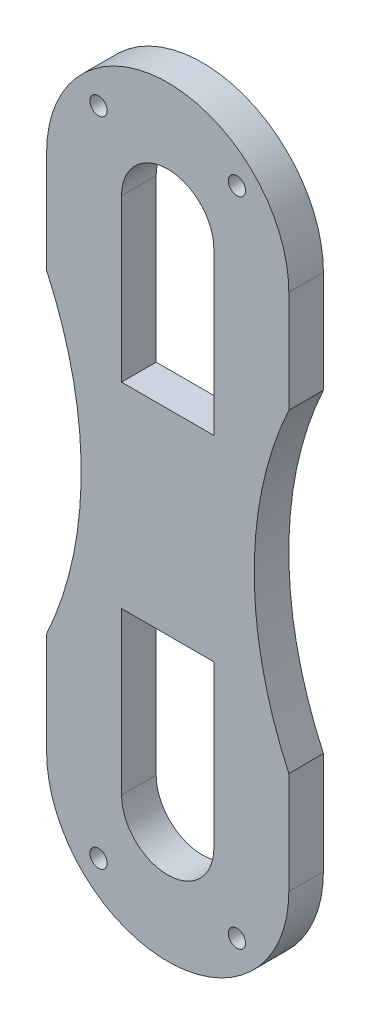
ISO-10303-21;
HEADER;
FILE_DESCRIPTION(('STEP AP214'),'2;1');
FILE_NAME('part.step','',(''),(''),'','','');
FILE_SCHEMA(('AUTOMOTIVE_DESIGN { 1 0 10303 214 1 1 1 1 }'));
ENDSEC;
DATA;
#1=APPLICATION_CONTEXT('core data for automotive mechanical design processes');
#2=APPLICATION_PROTOCOL_DEFINITION('international standard','automotive_design',2000,#1);
#3=PRODUCT_CONTEXT('',#1,'mechanical');
#4=PRODUCT('Part','Part','',(#3));
#5=PRODUCT_RELATED_PRODUCT_CATEGORY('part','',(#4));
#6=PRODUCT_DEFINITION_FORMATION('','',#4);
#7=PRODUCT_DEFINITION_CONTEXT('part definition',#1,'design');
#8=PRODUCT_DEFINITION('design','',#6,#7);
#9=PRODUCT_DEFINITION_SHAPE('','',#8);
#10=(LENGTH_UNIT() NAMED_UNIT(*) SI_UNIT(.MILLI.,.METRE.));
#11=(NAMED_UNIT(*) PLANE_ANGLE_UNIT() SI_UNIT($,.RADIAN.));
#12=(NAMED_UNIT(*) SI_UNIT($,.STERADIAN.) SOLID_ANGLE_UNIT());
#13=UNCERTAINTY_MEASURE_WITH_UNIT(LENGTH_MEASURE(1.E-05),#10,'distance_accuracy_value','');
#14=(GEOMETRIC_REPRESENTATION_CONTEXT(3) GLOBAL_UNCERTAINTY_ASSIGNED_CONTEXT((#13)) GLOBAL_UNIT_ASSIGNED_CONTEXT((#10,
#11,#12)) REPRESENTATION_CONTEXT('',''));
#15=CARTESIAN_POINT('',(0.,0.,0.));
#16=DIRECTION('',(0.,0.,1.));
#17=DIRECTION('',(1.,0.,0.));
#18=AXIS2_PLACEMENT_3D('',#15,#16,#17);
#19=CARTESIAN_POINT('',(4.,0.,3.));
#20=DIRECTION('',(-1.,0.,0.));
#21=DIRECTION('',(0.,-1.,0.));
#22=AXIS2_PLACEMENT_3D('',#19,#20,#21);
#23=PLANE('',#22);
#24=DIRECTION('',(0.,1.,0.));
#25=VECTOR('',#24,1.);
#26=CARTESIAN_POINT('',(4.,0.,0.));
#27=LINE('',#26,#25);
#28=CARTESIAN_POINT('',(3.99999999999999,-22.5000003712386,0.));
#29=VERTEX_POINT('',#28);
#30=CARTESIAN_POINT('',(4.,-8.50000000000002,0.));
#31=VERTEX_POINT('',#30);
#32=EDGE_CURVE('E258',#29,#31,#27,.T.);
#33=ORIENTED_EDGE('',*,*,#32,.F.);
#34=DIRECTION('',(0.,0.,-1.));
#35=VECTOR('',#34,1.);
#36=CARTESIAN_POINT('',(3.99999999999999,-22.5000003712386,3.));
#37=LINE('',#36,#35);
#38=CARTESIAN_POINT('',(3.99999999999999,-22.5000003712386,3.));
#39=VERTEX_POINT('',#38);
#40=EDGE_CURVE('E11',#39,#29,#37,.T.);
#41=ORIENTED_EDGE('',*,*,#40,.F.);
#42=DIRECTION('',(0.,1.,0.));
#43=VECTOR('',#42,1.);
#44=CARTESIAN_POINT('',(4.,0.,3.));
#45=LINE('',#44,#43);
#46=CARTESIAN_POINT('',(4.,-8.50000000000002,3.));
#47=VERTEX_POINT('',#46);
#48=EDGE_CURVE('E170',#39,#47,#45,.T.);
#49=ORIENTED_EDGE('',*,*,#48,.T.);
#50=DIRECTION('',(0.,0.,-1.));
#51=VECTOR('',#50,1.);
#52=CARTESIAN_POINT('',(4.,-8.50000000000002,3.));
#53=LINE('',#52,#51);
#54=EDGE_CURVE('E111',#47,#31,#53,.T.);
#55=ORIENTED_EDGE('',*,*,#54,.T.);
#56=EDGE_LOOP('',(#33,#41,#49,#55));
#57=FACE_BOUND('',#56,.T.);
#58=ADVANCED_FACE('F34',(#57),#23,.T.);
#59=CARTESIAN_POINT('',(0.,-22.5,3.));
#60=DIRECTION('',(0.,0.,-1.));
#61=DIRECTION('',(-1.,0.,0.));
#62=AXIS2_PLACEMENT_3D('',#59,#60,#61);
#63=CYLINDRICAL_SURFACE('',#62,4.00000000000002);
#64=CARTESIAN_POINT('',(0.,-22.5,0.));
#65=DIRECTION('',(0.,0.,1.));
#66=DIRECTION('',(1.,0.,0.));
#67=AXIS2_PLACEMENT_3D('',#64,#65,#66);
#68=CIRCLE('',#67,4.00000000000002);
#69=CARTESIAN_POINT('',(-4.00000000000001,-22.4999996286907,0.));
#70=VERTEX_POINT('',#69);
#71=EDGE_CURVE('E175',#29,#70,#68,.F.);
#72=ORIENTED_EDGE('',*,*,#71,.T.);
#73=DIRECTION('',(0.,0.,-1.));
#74=VECTOR('',#73,1.);
#75=CARTESIAN_POINT('',(-4.00000000000001,-22.4999996286907,3.));
#76=LINE('',#75,#74);
#77=CARTESIAN_POINT('',(-4.00000000000001,-22.4999996286907,3.));
#78=VERTEX_POINT('',#77);
#79=EDGE_CURVE('E44',#78,#70,#76,.T.);
#80=ORIENTED_EDGE('',*,*,#79,.F.);
#81=CARTESIAN_POINT('',(0.,-22.5,3.));
#82=DIRECTION('',(0.,0.,1.));
#83=DIRECTION('',(1.,0.,0.));
#84=AXIS2_PLACEMENT_3D('',#81,#82,#83);
#85=CIRCLE('',#84,4.00000000000002);
#86=EDGE_CURVE('E165',#39,#78,#85,.F.);
#87=ORIENTED_EDGE('',*,*,#86,.F.);
#88=ORIENTED_EDGE('',*,*,#40,.T.);
#89=EDGE_LOOP('',(#72,#80,#87,#88));
#90=FACE_BOUND('',#89,.T.);
#91=ADVANCED_FACE('F173',(#90),#63,.F.);
#92=CARTESIAN_POINT('',(-4.00000000000001,0.,3.));
#93=DIRECTION('',(-1.,0.,0.));
#94=DIRECTION('',(0.,-1.,0.));
#95=AXIS2_PLACEMENT_3D('',#92,#93,#94);
#96=PLANE('',#95);
#97=DIRECTION('',(0.,1.,0.));
#98=VECTOR('',#97,1.);
#99=CARTESIAN_POINT('',(-4.00000000000001,0.,0.));
#100=LINE('',#99,#98);
#101=CARTESIAN_POINT('',(-4.00000000000001,-8.50000000000002,0.));
#102=VERTEX_POINT('',#101);
#103=EDGE_CURVE('E261',#70,#102,#100,.T.);
#104=ORIENTED_EDGE('',*,*,#103,.T.);
#105=DIRECTION('',(0.,0.,-1.));
#106=VECTOR('',#105,1.);
#107=CARTESIAN_POINT('',(-4.00000000000001,-8.50000000000002,3.));
#108=LINE('',#107,#106);
#109=CARTESIAN_POINT('',(-4.00000000000001,-8.50000000000002,3.));
#110=VERTEX_POINT('',#109);
#111=EDGE_CURVE('E164',#110,#102,#108,.T.);
#112=ORIENTED_EDGE('',*,*,#111,.F.);
#113=DIRECTION('',(0.,1.,0.));
#114=VECTOR('',#113,1.);
#115=CARTESIAN_POINT('',(-4.00000000000001,0.,3.));
#116=LINE('',#115,#114);
#117=EDGE_CURVE('E158',#78,#110,#116,.T.);
#118=ORIENTED_EDGE('',*,*,#117,.F.);
#119=ORIENTED_EDGE('',*,*,#79,.T.);
#120=EDGE_LOOP('',(#104,#112,#118,#119));
#121=FACE_BOUND('',#120,.T.);
#122=ADVANCED_FACE('F161',(#121),#96,.F.);
#123=CARTESIAN_POINT('',(-10.5,0.,3.));
#124=DIRECTION('',(1.,0.,0.));
#125=DIRECTION('',(0.,1.,0.));
#126=AXIS2_PLACEMENT_3D('',#123,#124,#125);
#127=PLANE('',#126);
#128=DIRECTION('',(0.,-1.,0.));
#129=VECTOR('',#128,1.);
#130=CARTESIAN_POINT('',(-10.5,0.,0.));
#131=LINE('',#130,#129);
#132=CARTESIAN_POINT('',(-10.5,22.5,0.));
#133=VERTEX_POINT('',#132);
#134=CARTESIAN_POINT('',(-10.5,13.6381816969859,0.));
#135=VERTEX_POINT('',#134);
#136=EDGE_CURVE('E236',#133,#135,#131,.T.);
#137=ORIENTED_EDGE('',*,*,#136,.T.);
#138=DIRECTION('',(0.,0.,-1.));
#139=VECTOR('',#138,1.);
#140=CARTESIAN_POINT('',(-10.5,13.6381816969859,3.));
#141=LINE('',#140,#139);
#142=CARTESIAN_POINT('',(-10.5,13.6381816969859,3.));
#143=VERTEX_POINT('',#142);
#144=EDGE_CURVE('E196',#143,#135,#141,.T.);
#145=ORIENTED_EDGE('',*,*,#144,.F.);
#146=DIRECTION('',(0.,-1.,0.));
#147=VECTOR('',#146,1.);
#148=CARTESIAN_POINT('',(-10.5,0.,3.));
#149=LINE('',#148,#147);
#150=CARTESIAN_POINT('',(-10.5,22.5,3.));
#151=VERTEX_POINT('',#150);
#152=EDGE_CURVE('E288',#151,#143,#149,.T.);
#153=ORIENTED_EDGE('',*,*,#152,.F.);
#154=DIRECTION('',(0.,0.,-1.));
#155=VECTOR('',#154,1.);
#156=CARTESIAN_POINT('',(-10.5,22.5,3.));
#157=LINE('',#156,#155);
#158=EDGE_CURVE('E180',#151,#133,#157,.T.);
#159=ORIENTED_EDGE('',*,*,#158,.T.);
#160=EDGE_LOOP('',(#137,#145,#153,#159));
#161=FACE_BOUND('',#160,.T.);
#162=ADVANCED_FACE('F373',(#161),#127,.F.);
#163=CARTESIAN_POINT('',(-40.,0.,3.));
#164=DIRECTION('',(0.,0.,-1.));
#165=DIRECTION('',(-1.,0.,0.));
#166=AXIS2_PLACEMENT_3D('',#163,#164,#165);
#167=CYLINDRICAL_SURFACE('',#166,32.5);
#168=CARTESIAN_POINT('',(-40.,0.,0.));
#169=DIRECTION('',(0.,0.,1.));
#170=DIRECTION('',(1.,0.,0.));
#171=AXIS2_PLACEMENT_3D('',#168,#169,#170);
#172=CIRCLE('',#171,32.5);
#173=CARTESIAN_POINT('',(-10.5,-13.6381816969859,0.));
#174=VERTEX_POINT('',#173);
#175=EDGE_CURVE('E239',#135,#174,#172,.F.);
#176=ORIENTED_EDGE('',*,*,#175,.T.);
#177=DIRECTION('',(0.,0.,-1.));
#178=VECTOR('',#177,1.);
#179=CARTESIAN_POINT('',(-10.5,-13.6381816969859,3.));
#180=LINE('',#179,#178);
#181=CARTESIAN_POINT('',(-10.5,-13.6381816969859,3.));
#182=VERTEX_POINT('',#181);
#183=EDGE_CURVE('E193',#182,#174,#180,.T.);
#184=ORIENTED_EDGE('',*,*,#183,.F.);
#185=CARTESIAN_POINT('',(-40.,0.,3.));
#186=DIRECTION('',(0.,0.,1.));
#187=DIRECTION('',(1.,0.,0.));
#188=AXIS2_PLACEMENT_3D('',#185,#186,#187);
#189=CIRCLE('',#188,32.5);
#190=EDGE_CURVE('E291',#143,#182,#189,.F.);
#191=ORIENTED_EDGE('',*,*,#190,.F.);
#192=ORIENTED_EDGE('',*,*,#144,.T.);
#193=EDGE_LOOP('',(#176,#184,#191,#192));
#194=FACE_BOUND('',#193,.T.);
#195=ADVANCED_FACE('F369',(#194),#167,.F.);
#196=CARTESIAN_POINT('',(-10.5,0.,3.));
#197=DIRECTION('',(1.,0.,0.));
#198=DIRECTION('',(0.,1.,0.));
#199=AXIS2_PLACEMENT_3D('',#196,#197,#198);
#200=PLANE('',#199);
#201=DIRECTION('',(0.,-1.,0.));
#202=VECTOR('',#201,1.);
#203=CARTESIAN_POINT('',(-10.5,0.,0.));
#204=LINE('',#203,#202);
#205=CARTESIAN_POINT('',(-10.5,-22.5,0.));
#206=VERTEX_POINT('',#205);
#207=EDGE_CURVE('E241',#174,#206,#204,.T.);
#208=ORIENTED_EDGE('',*,*,#207,.T.);
#209=DIRECTION('',(0.,0.,-1.));
#210=VECTOR('',#209,1.);
#211=CARTESIAN_POINT('',(-10.5,-22.5,3.));
#212=LINE('',#211,#210);
#213=CARTESIAN_POINT('',(-10.5,-22.5,3.));
#214=VERTEX_POINT('',#213);
#215=EDGE_CURVE('E191',#214,#206,#212,.T.);
#216=ORIENTED_EDGE('',*,*,#215,.F.);
#217=DIRECTION('',(0.,-1.,0.));
#218=VECTOR('',#217,1.);
#219=CARTESIAN_POINT('',(-10.5,0.,3.));
#220=LINE('',#219,#218);
#221=EDGE_CURVE('E293',#182,#214,#220,.T.);
#222=ORIENTED_EDGE('',*,*,#221,.F.);
#223=ORIENTED_EDGE('',*,*,#183,.T.);
#224=EDGE_LOOP('',(#208,#216,#222,#223));
#225=FACE_BOUND('',#224,.T.);
#226=ADVANCED_FACE('F365',(#225),#200,.F.);
#227=CARTESIAN_POINT('',(0.,-22.5,3.));
#228=DIRECTION('',(0.,0.,-1.));
#229=DIRECTION('',(-1.,0.,0.));
#230=AXIS2_PLACEMENT_3D('',#227,#228,#229);
#231=CYLINDRICAL_SURFACE('',#230,10.5);
#232=CARTESIAN_POINT('',(0.,-22.5,0.));
#233=DIRECTION('',(0.,0.,1.));
#234=DIRECTION('',(1.,0.,0.));
#235=AXIS2_PLACEMENT_3D('',#232,#233,#234);
#236=CIRCLE('',#235,10.5);
#237=CARTESIAN_POINT('',(10.5,-22.5,0.));
#238=VERTEX_POINT('',#237);
#239=EDGE_CURVE('E244',#238,#206,#236,.F.);
#240=ORIENTED_EDGE('',*,*,#239,.F.);
#241=DIRECTION('',(0.,0.,-1.));
#242=VECTOR('',#241,1.);
#243=CARTESIAN_POINT('',(10.5,-22.5,3.));
#244=LINE('',#243,#242);
#245=CARTESIAN_POINT('',(10.5,-22.5,3.));
#246=VERTEX_POINT('',#245);
#247=EDGE_CURVE('E189',#246,#238,#244,.T.);
#248=ORIENTED_EDGE('',*,*,#247,.F.);
#249=CARTESIAN_POINT('',(0.,-22.5,3.));
#250=DIRECTION('',(0.,0.,1.));
#251=DIRECTION('',(1.,0.,0.));
#252=AXIS2_PLACEMENT_3D('',#249,#250,#251);
#253=CIRCLE('',#252,10.5);
#254=EDGE_CURVE('E295',#246,#214,#253,.F.);
#255=ORIENTED_EDGE('',*,*,#254,.T.);
#256=ORIENTED_EDGE('',*,*,#215,.T.);
#257=EDGE_LOOP('',(#240,#248,#255,#256));
#258=FACE_BOUND('',#257,.T.);
#259=ADVANCED_FACE('F361',(#258),#231,.T.);
#260=CARTESIAN_POINT('',(10.5,0.,3.));
#261=DIRECTION('',(1.,0.,0.));
#262=DIRECTION('',(0.,1.,0.));
#263=AXIS2_PLACEMENT_3D('',#260,#261,#262);
#264=PLANE('',#263);
#265=DIRECTION('',(0.,-1.,0.));
#266=VECTOR('',#265,1.);
#267=CARTESIAN_POINT('',(10.5,0.,0.));
#268=LINE('',#267,#266);
#269=CARTESIAN_POINT('',(10.5,-13.6381816969859,0.));
#270=VERTEX_POINT('',#269);
#271=EDGE_CURVE('E247',#270,#238,#268,.T.);
#272=ORIENTED_EDGE('',*,*,#271,.F.);
#273=DIRECTION('',(0.,0.,-1.));
#274=VECTOR('',#273,1.);
#275=CARTESIAN_POINT('',(10.5,-13.6381816969859,3.));
#276=LINE('',#275,#274);
#277=CARTESIAN_POINT('',(10.5,-13.6381816969859,3.));
#278=VERTEX_POINT('',#277);
#279=EDGE_CURVE('E187',#278,#270,#276,.T.);
#280=ORIENTED_EDGE('',*,*,#279,.F.);
#281=DIRECTION('',(0.,-1.,0.));
#282=VECTOR('',#281,1.);
#283=CARTESIAN_POINT('',(10.5,0.,3.));
#284=LINE('',#283,#282);
#285=EDGE_CURVE('E298',#278,#246,#284,.T.);
#286=ORIENTED_EDGE('',*,*,#285,.T.);
#287=ORIENTED_EDGE('',*,*,#247,.T.);
#288=EDGE_LOOP('',(#272,#280,#286,#287));
#289=FACE_BOUND('',#288,.T.);
#290=ADVANCED_FACE('F357',(#289),#264,.T.);
#291=CARTESIAN_POINT('',(40.,0.,3.));
#292=DIRECTION('',(0.,0.,-1.));
#293=DIRECTION('',(-1.,0.,0.));
#294=AXIS2_PLACEMENT_3D('',#291,#292,#293);
#295=CYLINDRICAL_SURFACE('',#294,32.5);
#296=CARTESIAN_POINT('',(40.,0.,0.));
#297=DIRECTION('',(0.,0.,1.));
#298=DIRECTION('',(1.,0.,0.));
#299=AXIS2_PLACEMENT_3D('',#296,#297,#298);
#300=CIRCLE('',#299,32.5);
#301=CARTESIAN_POINT('',(10.5,13.6381816969859,0.));
#302=VERTEX_POINT('',#301);
#303=EDGE_CURVE('E250',#302,#270,#300,.T.);
#304=ORIENTED_EDGE('',*,*,#303,.F.);
#305=DIRECTION('',(0.,0.,-1.));
#306=VECTOR('',#305,1.);
#307=CARTESIAN_POINT('',(10.5,13.6381816969859,3.));
#308=LINE('',#307,#306);
#309=CARTESIAN_POINT('',(10.5,13.6381816969859,3.));
#310=VERTEX_POINT('',#309);
#311=EDGE_CURVE('E185',#310,#302,#308,.T.);
#312=ORIENTED_EDGE('',*,*,#311,.F.);
#313=CARTESIAN_POINT('',(40.,0.,3.));
#314=DIRECTION('',(0.,0.,1.));
#315=DIRECTION('',(1.,0.,0.));
#316=AXIS2_PLACEMENT_3D('',#313,#314,#315);
#317=CIRCLE('',#316,32.5);
#318=EDGE_CURVE('E301',#310,#278,#317,.T.);
#319=ORIENTED_EDGE('',*,*,#318,.T.);
#320=ORIENTED_EDGE('',*,*,#279,.T.);
#321=EDGE_LOOP('',(#304,#312,#319,#320));
#322=FACE_BOUND('',#321,.T.);
#323=ADVANCED_FACE('F353',(#322),#295,.F.);
#324=CARTESIAN_POINT('',(10.5,0.,3.));
#325=DIRECTION('',(1.,0.,0.));
#326=DIRECTION('',(0.,1.,0.));
#327=AXIS2_PLACEMENT_3D('',#324,#325,#326);
#328=PLANE('',#327);
#329=DIRECTION('',(0.,-1.,0.));
#330=VECTOR('',#329,1.);
#331=CARTESIAN_POINT('',(10.5,0.,0.));
#332=LINE('',#331,#330);
#333=CARTESIAN_POINT('',(10.5,22.5,0.));
#334=VERTEX_POINT('',#333);
#335=EDGE_CURVE('E253',#334,#302,#332,.T.);
#336=ORIENTED_EDGE('',*,*,#335,.F.);
#337=DIRECTION('',(0.,0.,-1.));
#338=VECTOR('',#337,1.);
#339=CARTESIAN_POINT('',(10.5,22.5,3.));
#340=LINE('',#339,#338);
#341=CARTESIAN_POINT('',(10.5,22.5,3.));
#342=VERTEX_POINT('',#341);
#343=EDGE_CURVE('E183',#342,#334,#340,.T.);
#344=ORIENTED_EDGE('',*,*,#343,.F.);
#345=DIRECTION('',(0.,-1.,0.));
#346=VECTOR('',#345,1.);
#347=CARTESIAN_POINT('',(10.5,0.,3.));
#348=LINE('',#347,#346);
#349=EDGE_CURVE('E304',#342,#310,#348,.T.);
#350=ORIENTED_EDGE('',*,*,#349,.T.);
#351=ORIENTED_EDGE('',*,*,#311,.T.);
#352=EDGE_LOOP('',(#336,#344,#350,#351));
#353=FACE_BOUND('',#352,.T.);
#354=ADVANCED_FACE('F350',(#353),#328,.T.);
#355=CARTESIAN_POINT('',(0.,22.5,3.));
#356=DIRECTION('',(0.,0.,-1.));
#357=DIRECTION('',(-1.,0.,0.));
#358=AXIS2_PLACEMENT_3D('',#355,#356,#357);
#359=CYLINDRICAL_SURFACE('',#358,4.00000000000002);
#360=CARTESIAN_POINT('',(0.,22.5,0.));
#361=DIRECTION('',(0.,0.,1.));
#362=DIRECTION('',(1.,0.,0.));
#363=AXIS2_PLACEMENT_3D('',#360,#361,#362);
#364=CIRCLE('',#363,4.00000000000002);
#365=CARTESIAN_POINT('',(3.99999999999999,22.5000003712386,0.));
#366=VERTEX_POINT('',#365);
#367=CARTESIAN_POINT('',(-4.00000000000001,22.4999996286907,0.));
#368=VERTEX_POINT('',#367);
#369=EDGE_CURVE('E221',#366,#368,#364,.T.);
#370=ORIENTED_EDGE('',*,*,#369,.F.);
#371=DIRECTION('',(0.,0.,-1.));
#372=VECTOR('',#371,1.);
#373=CARTESIAN_POINT('',(3.99999999999999,22.5000003712386,3.));
#374=LINE('',#373,#372);
#375=CARTESIAN_POINT('',(3.99999999999999,22.5000003712386,3.));
#376=VERTEX_POINT('',#375);
#377=EDGE_CURVE('E38',#376,#366,#374,.T.);
#378=ORIENTED_EDGE('',*,*,#377,.F.);
#379=CARTESIAN_POINT('',(0.,22.5,3.));
#380=DIRECTION('',(0.,0.,1.));
#381=DIRECTION('',(1.,0.,0.));
#382=AXIS2_PLACEMENT_3D('',#379,#380,#381);
#383=CIRCLE('',#382,4.00000000000002);
#384=CARTESIAN_POINT('',(-4.00000000000001,22.4999996286907,3.));
#385=VERTEX_POINT('',#384);
#386=EDGE_CURVE('E278',#376,#385,#383,.T.);
#387=ORIENTED_EDGE('',*,*,#386,.T.);
#388=DIRECTION('',(0.,0.,-1.));
#389=VECTOR('',#388,1.);
#390=CARTESIAN_POINT('',(-4.00000000000001,22.4999996286907,3.));
#391=LINE('',#390,#389);
#392=EDGE_CURVE('E199',#385,#368,#391,.T.);
#393=ORIENTED_EDGE('',*,*,#392,.T.);
#394=EDGE_LOOP('',(#370,#378,#387,#393));
#395=FACE_BOUND('',#394,.T.);
#396=ADVANCED_FACE('F225',(#395),#359,.F.);
#397=CARTESIAN_POINT('',(4.,0.,3.));
#398=DIRECTION('',(1.,0.,0.));
#399=DIRECTION('',(0.,1.,0.));
#400=AXIS2_PLACEMENT_3D('',#397,#398,#399);
#401=PLANE('',#400);
#402=DIRECTION('',(0.,-1.,0.));
#403=VECTOR('',#402,1.);
#404=CARTESIAN_POINT('',(4.,0.,0.));
#405=LINE('',#404,#403);
#406=CARTESIAN_POINT('',(4.,8.50000000000002,0.));
#407=VERTEX_POINT('',#406);
#408=EDGE_CURVE('E212',#366,#407,#405,.T.);
#409=ORIENTED_EDGE('',*,*,#408,.T.);
#410=DIRECTION('',(0.,0.,-1.));
#411=VECTOR('',#410,1.);
#412=CARTESIAN_POINT('',(4.,8.50000000000002,3.));
#413=LINE('',#412,#411);
#414=CARTESIAN_POINT('',(4.,8.50000000000002,3.));
#415=VERTEX_POINT('',#414);
#416=EDGE_CURVE('E203',#415,#407,#413,.T.);
#417=ORIENTED_EDGE('',*,*,#416,.F.);
#418=DIRECTION('',(0.,-1.,0.));
#419=VECTOR('',#418,1.);
#420=CARTESIAN_POINT('',(4.,0.,3.));
#421=LINE('',#420,#419);
#422=EDGE_CURVE('E214',#376,#415,#421,.T.);
#423=ORIENTED_EDGE('',*,*,#422,.F.);
#424=ORIENTED_EDGE('',*,*,#377,.T.);
#425=EDGE_LOOP('',(#409,#417,#423,#424));
#426=FACE_BOUND('',#425,.T.);
#427=ADVANCED_FACE('F211',(#426),#401,.F.);
#428=CARTESIAN_POINT('',(0.,8.50000000000002,3.));
#429=DIRECTION('',(0.,1.,0.));
#430=DIRECTION('',(-1.,0.,0.));
#431=AXIS2_PLACEMENT_3D('',#428,#429,#430);
#432=PLANE('',#431);
#433=DIRECTION('',(1.,0.,0.));
#434=VECTOR('',#433,1.);
#435=CARTESIAN_POINT('',(0.,8.50000000000002,0.));
#436=LINE('',#435,#434);
#437=CARTESIAN_POINT('',(-4.00000000000001,8.50000000000002,0.));
#438=VERTEX_POINT('',#437);
#439=EDGE_CURVE('E223',#438,#407,#436,.T.);
#440=ORIENTED_EDGE('',*,*,#439,.F.);
#441=DIRECTION('',(0.,0.,-1.));
#442=VECTOR('',#441,1.);
#443=CARTESIAN_POINT('',(-4.00000000000001,8.50000000000002,3.));
#444=LINE('',#443,#442);
#445=CARTESIAN_POINT('',(-4.00000000000001,8.50000000000002,3.));
#446=VERTEX_POINT('',#445);
#447=EDGE_CURVE('E201',#446,#438,#444,.T.);
#448=ORIENTED_EDGE('',*,*,#447,.F.);
#449=DIRECTION('',(1.,0.,0.));
#450=VECTOR('',#449,1.);
#451=CARTESIAN_POINT('',(0.,8.50000000000002,3.));
#452=LINE('',#451,#450);
#453=EDGE_CURVE('E283',#446,#415,#452,.T.);
#454=ORIENTED_EDGE('',*,*,#453,.T.);
#455=ORIENTED_EDGE('',*,*,#416,.T.);
#456=EDGE_LOOP('',(#440,#448,#454,#455));
#457=FACE_BOUND('',#456,.T.);
#458=ADVANCED_FACE('F378',(#457),#432,.T.);
#459=CARTESIAN_POINT('',(6.,-28.25,3.));
#460=DIRECTION('',(0.,0.,-1.));
#461=DIRECTION('',(-1.,0.,0.));
#462=AXIS2_PLACEMENT_3D('',#459,#460,#461);
#463=CYLINDRICAL_SURFACE('',#462,0.75);
#464=CARTESIAN_POINT('',(6.,-28.25,3.));
#465=DIRECTION('',(0.,0.,1.));
#466=DIRECTION('',(1.,0.,0.));
#467=AXIS2_PLACEMENT_3D('',#464,#465,#466);
#468=CIRCLE('',#467,0.75);
#469=CARTESIAN_POINT('',(6.75,-28.25,3.));
#470=VERTEX_POINT('',#469);
#471=EDGE_CURVE('E311',#470,#470,#468,.T.);
#472=ORIENTED_EDGE('',*,*,#471,.T.);
#473=EDGE_LOOP('',(#472));
#474=FACE_BOUND('',#473,.T.);
#475=CARTESIAN_POINT('',(6.,-28.25,0.));
#476=DIRECTION('',(0.,0.,1.));
#477=DIRECTION('',(1.,0.,0.));
#478=AXIS2_PLACEMENT_3D('',#475,#476,#477);
#479=CIRCLE('',#478,0.75);
#480=CARTESIAN_POINT('',(6.75,-28.25,0.));
#481=VERTEX_POINT('',#480);
#482=EDGE_CURVE('E264',#481,#481,#479,.T.);
#483=ORIENTED_EDGE('',*,*,#482,.F.);
#484=EDGE_LOOP('',(#483));
#485=FACE_BOUND('',#484,.T.);
#486=ADVANCED_FACE('F381',(#474,#485),#463,.F.);
#487=CARTESIAN_POINT('',(0.,-8.50000000000002,3.));
#488=DIRECTION('',(0.,1.,0.));
#489=DIRECTION('',(-1.,0.,0.));
#490=AXIS2_PLACEMENT_3D('',#487,#488,#489);
#491=PLANE('',#490);
#492=DIRECTION('',(1.,0.,0.));
#493=VECTOR('',#492,1.);
#494=CARTESIAN_POINT('',(0.,-8.50000000000002,0.));
#495=LINE('',#494,#493);
#496=EDGE_CURVE('E104',#102,#31,#495,.T.);
#497=ORIENTED_EDGE('',*,*,#496,.T.);
#498=ORIENTED_EDGE('',*,*,#54,.F.);
#499=DIRECTION('',(1.,0.,0.));
#500=VECTOR('',#499,1.);
#501=CARTESIAN_POINT('',(0.,-8.50000000000002,3.));
#502=LINE('',#501,#500);
#503=EDGE_CURVE('E53',#110,#47,#502,.T.);
#504=ORIENTED_EDGE('',*,*,#503,.F.);
#505=ORIENTED_EDGE('',*,*,#111,.T.);
#506=EDGE_LOOP('',(#497,#498,#504,#505));
#507=FACE_BOUND('',#506,.T.);
#508=ADVANCED_FACE('F348',(#507),#491,.F.);
#509=CARTESIAN_POINT('',(0.,22.5,3.));
#510=DIRECTION('',(0.,0.,-1.));
#511=DIRECTION('',(-1.,0.,0.));
#512=AXIS2_PLACEMENT_3D('',#509,#510,#511);
#513=CYLINDRICAL_SURFACE('',#512,10.5);
#514=CARTESIAN_POINT('',(0.,22.5,0.));
#515=DIRECTION('',(0.,0.,1.));
#516=DIRECTION('',(1.,0.,0.));
#517=AXIS2_PLACEMENT_3D('',#514,#515,#516);
#518=CIRCLE('',#517,10.5);
#519=EDGE_CURVE('E256',#334,#133,#518,.T.);
#520=ORIENTED_EDGE('',*,*,#519,.T.);
#521=ORIENTED_EDGE('',*,*,#158,.F.);
#522=CARTESIAN_POINT('',(0.,22.5,3.));
#523=DIRECTION('',(0.,0.,1.));
#524=DIRECTION('',(1.,0.,0.));
#525=AXIS2_PLACEMENT_3D('',#522,#523,#524);
#526=CIRCLE('',#525,10.5);
#527=EDGE_CURVE('E307',#342,#151,#526,.T.);
#528=ORIENTED_EDGE('',*,*,#527,.F.);
#529=ORIENTED_EDGE('',*,*,#343,.T.);
#530=EDGE_LOOP('',(#520,#521,#528,#529));
#531=FACE_BOUND('',#530,.T.);
#532=ADVANCED_FACE('F334',(#531),#513,.T.);
#533=CARTESIAN_POINT('',(-4.00000000000001,0.,3.));
#534=DIRECTION('',(1.,0.,0.));
#535=DIRECTION('',(0.,1.,0.));
#536=AXIS2_PLACEMENT_3D('',#533,#534,#535);
#537=PLANE('',#536);
#538=DIRECTION('',(0.,-1.,0.));
#539=VECTOR('',#538,1.);
#540=CARTESIAN_POINT('',(-4.00000000000001,0.,0.));
#541=LINE('',#540,#539);
#542=EDGE_CURVE('E234',#368,#438,#541,.T.);
#543=ORIENTED_EDGE('',*,*,#542,.F.);
#544=ORIENTED_EDGE('',*,*,#392,.F.);
#545=DIRECTION('',(0.,-1.,0.));
#546=VECTOR('',#545,1.);
#547=CARTESIAN_POINT('',(-4.00000000000001,0.,3.));
#548=LINE('',#547,#546);
#549=EDGE_CURVE('E285',#385,#446,#548,.T.);
#550=ORIENTED_EDGE('',*,*,#549,.T.);
#551=ORIENTED_EDGE('',*,*,#447,.T.);
#552=EDGE_LOOP('',(#543,#544,#550,#551));
#553=FACE_BOUND('',#552,.T.);
#554=ADVANCED_FACE('F326',(#553),#537,.T.);
#555=CARTESIAN_POINT('',(-6.,28.25,3.));
#556=DIRECTION('',(0.,0.,-1.));
#557=DIRECTION('',(-1.,0.,0.));
#558=AXIS2_PLACEMENT_3D('',#555,#556,#557);
#559=CYLINDRICAL_SURFACE('',#558,0.75);
#560=CARTESIAN_POINT('',(-6.,28.25,3.));
#561=DIRECTION('',(0.,0.,1.));
#562=DIRECTION('',(1.,0.,0.));
#563=AXIS2_PLACEMENT_3D('',#560,#561,#562);
#564=CIRCLE('',#563,0.75);
#565=CARTESIAN_POINT('',(-5.25,28.25,3.));
#566=VERTEX_POINT('',#565);
#567=EDGE_CURVE('E273',#566,#566,#564,.T.);
#568=ORIENTED_EDGE('',*,*,#567,.T.);
#569=EDGE_LOOP('',(#568));
#570=FACE_BOUND('',#569,.T.);
#571=CARTESIAN_POINT('',(-6.,28.25,0.));
#572=DIRECTION('',(0.,0.,1.));
#573=DIRECTION('',(1.,0.,0.));
#574=AXIS2_PLACEMENT_3D('',#571,#572,#573);
#575=CIRCLE('',#574,0.75);
#576=CARTESIAN_POINT('',(-5.25,28.25,0.));
#577=VERTEX_POINT('',#576);
#578=EDGE_CURVE('E226',#577,#577,#575,.T.);
#579=ORIENTED_EDGE('',*,*,#578,.F.);
#580=EDGE_LOOP('',(#579));
#581=FACE_BOUND('',#580,.T.);
#582=ADVANCED_FACE('F324',(#570,#581),#559,.F.);
#583=CARTESIAN_POINT('',(6.,28.25,3.));
#584=DIRECTION('',(0.,0.,-1.));
#585=DIRECTION('',(-1.,0.,0.));
#586=AXIS2_PLACEMENT_3D('',#583,#584,#585);
#587=CYLINDRICAL_SURFACE('',#586,0.75);
#588=CARTESIAN_POINT('',(6.,28.25,3.));
#589=DIRECTION('',(0.,0.,1.));
#590=DIRECTION('',(1.,0.,0.));
#591=AXIS2_PLACEMENT_3D('',#588,#589,#590);
#592=CIRCLE('',#591,0.75);
#593=CARTESIAN_POINT('',(6.75,28.25,3.));
#594=VERTEX_POINT('',#593);
#595=EDGE_CURVE('E269',#594,#594,#592,.F.);
#596=ORIENTED_EDGE('',*,*,#595,.F.);
#597=EDGE_LOOP('',(#596));
#598=FACE_BOUND('',#597,.T.);
#599=CARTESIAN_POINT('',(6.,28.25,0.));
#600=DIRECTION('',(0.,0.,1.));
#601=DIRECTION('',(1.,0.,0.));
#602=AXIS2_PLACEMENT_3D('',#599,#600,#601);
#603=CIRCLE('',#602,0.75);
#604=CARTESIAN_POINT('',(6.75,28.25,0.));
#605=VERTEX_POINT('',#604);
#606=EDGE_CURVE('E229',#605,#605,#603,.F.);
#607=ORIENTED_EDGE('',*,*,#606,.T.);
#608=EDGE_LOOP('',(#607));
#609=FACE_BOUND('',#608,.T.);
#610=ADVANCED_FACE('F36',(#598,#609),#587,.F.);
#611=CARTESIAN_POINT('',(-6.,-28.25,3.));
#612=DIRECTION('',(0.,0.,-1.));
#613=DIRECTION('',(-1.,0.,0.));
#614=AXIS2_PLACEMENT_3D('',#611,#612,#613);
#615=CYLINDRICAL_SURFACE('',#614,0.75);
#616=CARTESIAN_POINT('',(-6.,-28.25,3.));
#617=DIRECTION('',(0.,0.,1.));
#618=DIRECTION('',(1.,0.,0.));
#619=AXIS2_PLACEMENT_3D('',#616,#617,#618);
#620=CIRCLE('',#619,0.75);
#621=CARTESIAN_POINT('',(-5.25,-28.25,3.));
#622=VERTEX_POINT('',#621);
#623=EDGE_CURVE('E202',#622,#622,#620,.F.);
#624=ORIENTED_EDGE('',*,*,#623,.F.);
#625=EDGE_LOOP('',(#624));
#626=FACE_BOUND('',#625,.T.);
#627=CARTESIAN_POINT('',(-6.,-28.25,0.));
#628=DIRECTION('',(0.,0.,1.));
#629=DIRECTION('',(1.,0.,0.));
#630=AXIS2_PLACEMENT_3D('',#627,#628,#629);
#631=CIRCLE('',#630,0.75);
#632=CARTESIAN_POINT('',(-5.25,-28.25,0.));
#633=VERTEX_POINT('',#632);
#634=EDGE_CURVE('E267',#633,#633,#631,.F.);
#635=ORIENTED_EDGE('',*,*,#634,.T.);
#636=EDGE_LOOP('',(#635));
#637=FACE_BOUND('',#636,.T.);
#638=ADVANCED_FACE('F332',(#626,#637),#615,.F.);
#639=CARTESIAN_POINT('',(0.,0.,3.));
#640=DIRECTION('',(0.,0.,1.));
#641=DIRECTION('',(1.,0.,0.));
#642=AXIS2_PLACEMENT_3D('',#639,#640,#641);
#643=PLANE('',#642);
#644=ORIENTED_EDGE('',*,*,#595,.T.);
#645=EDGE_LOOP('',(#644));
#646=FACE_BOUND('',#645,.T.);
#647=ORIENTED_EDGE('',*,*,#567,.F.);
#648=EDGE_LOOP('',(#647));
#649=FACE_BOUND('',#648,.T.);
#650=ORIENTED_EDGE('',*,*,#386,.F.);
#651=ORIENTED_EDGE('',*,*,#422,.T.);
#652=ORIENTED_EDGE('',*,*,#453,.F.);
#653=ORIENTED_EDGE('',*,*,#549,.F.);
#654=EDGE_LOOP('',(#650,#651,#652,#653));
#655=FACE_BOUND('',#654,.T.);
#656=ORIENTED_EDGE('',*,*,#152,.T.);
#657=ORIENTED_EDGE('',*,*,#190,.T.);
#658=ORIENTED_EDGE('',*,*,#221,.T.);
#659=ORIENTED_EDGE('',*,*,#254,.F.);
#660=ORIENTED_EDGE('',*,*,#285,.F.);
#661=ORIENTED_EDGE('',*,*,#318,.F.);
#662=ORIENTED_EDGE('',*,*,#349,.F.);
#663=ORIENTED_EDGE('',*,*,#527,.T.);
#664=EDGE_LOOP('',(#656,#657,#658,#659,#660,#661,#662,#663));
#665=FACE_BOUND('',#664,.T.);
#666=ORIENTED_EDGE('',*,*,#48,.F.);
#667=ORIENTED_EDGE('',*,*,#86,.T.);
#668=ORIENTED_EDGE('',*,*,#117,.T.);
#669=ORIENTED_EDGE('',*,*,#503,.T.);
#670=EDGE_LOOP('',(#666,#667,#668,#669));
#671=FACE_BOUND('',#670,.T.);
#672=ORIENTED_EDGE('',*,*,#471,.F.);
#673=EDGE_LOOP('',(#672));
#674=FACE_BOUND('',#673,.T.);
#675=ORIENTED_EDGE('',*,*,#623,.T.);
#676=EDGE_LOOP('',(#675));
#677=FACE_BOUND('',#676,.T.);
#678=ADVANCED_FACE('F168',(#646,#649,#655,#665,#671,#674,#677),#643,.T.);
#679=CARTESIAN_POINT('',(0.,0.,0.));
#680=DIRECTION('',(0.,0.,1.));
#681=DIRECTION('',(1.,0.,0.));
#682=AXIS2_PLACEMENT_3D('',#679,#680,#681);
#683=PLANE('',#682);
#684=ORIENTED_EDGE('',*,*,#606,.F.);
#685=EDGE_LOOP('',(#684));
#686=FACE_BOUND('',#685,.T.);
#687=ORIENTED_EDGE('',*,*,#578,.T.);
#688=EDGE_LOOP('',(#687));
#689=FACE_BOUND('',#688,.T.);
#690=ORIENTED_EDGE('',*,*,#369,.T.);
#691=ORIENTED_EDGE('',*,*,#542,.T.);
#692=ORIENTED_EDGE('',*,*,#439,.T.);
#693=ORIENTED_EDGE('',*,*,#408,.F.);
#694=EDGE_LOOP('',(#690,#691,#692,#693));
#695=FACE_BOUND('',#694,.T.);
#696=ORIENTED_EDGE('',*,*,#136,.F.);
#697=ORIENTED_EDGE('',*,*,#519,.F.);
#698=ORIENTED_EDGE('',*,*,#335,.T.);
#699=ORIENTED_EDGE('',*,*,#303,.T.);
#700=ORIENTED_EDGE('',*,*,#271,.T.);
#701=ORIENTED_EDGE('',*,*,#239,.T.);
#702=ORIENTED_EDGE('',*,*,#207,.F.);
#703=ORIENTED_EDGE('',*,*,#175,.F.);
#704=EDGE_LOOP('',(#696,#697,#698,#699,#700,#701,#702,#703));
#705=FACE_BOUND('',#704,.T.);
#706=ORIENTED_EDGE('',*,*,#32,.T.);
#707=ORIENTED_EDGE('',*,*,#496,.F.);
#708=ORIENTED_EDGE('',*,*,#103,.F.);
#709=ORIENTED_EDGE('',*,*,#71,.F.);
#710=EDGE_LOOP('',(#706,#707,#708,#709));
#711=FACE_BOUND('',#710,.T.);
#712=ORIENTED_EDGE('',*,*,#482,.T.);
#713=EDGE_LOOP('',(#712));
#714=FACE_BOUND('',#713,.T.);
#715=ORIENTED_EDGE('',*,*,#634,.F.);
#716=EDGE_LOOP('',(#715));
#717=FACE_BOUND('',#716,.T.);
#718=ADVANCED_FACE('F218',(#686,#689,#695,#705,#711,#714,#717),#683,.F.);
#719=CLOSED_SHELL('',(#58,#91,#122,#162,#195,#226,#259,#290,#323,#354,#396,#427,#458,#486,#508,
#532,#554,#582,#610,#638,#678,#718));
#720=MANIFOLD_SOLID_BREP('B2',#719);
#721=ADVANCED_BREP_SHAPE_REPRESENTATION('',(#18,#720),#14);
#722=SHAPE_DEFINITION_REPRESENTATION(#9,#721);
ENDSEC;
END-ISO-10303-21;
